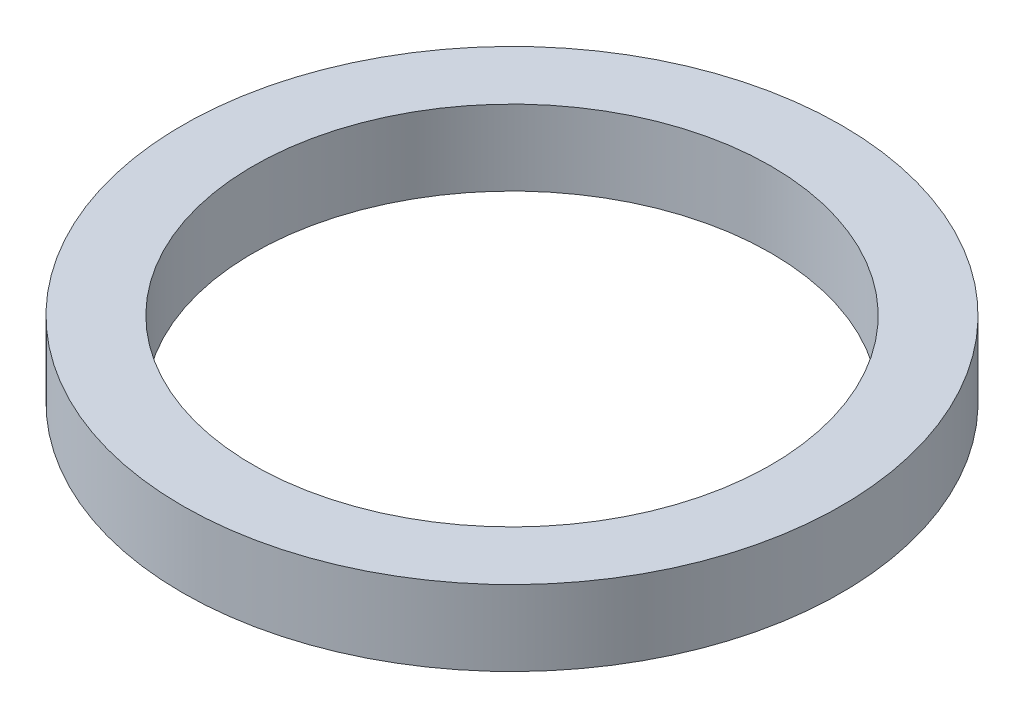
ISO-10303-21;
HEADER;
FILE_DESCRIPTION(('STEP AP214'),'2;1');
FILE_NAME('part.step','',(''),(''),'','','');
FILE_SCHEMA(('AUTOMOTIVE_DESIGN { 1 0 10303 214 1 1 1 1 }'));
ENDSEC;
DATA;
#1=APPLICATION_CONTEXT('core data for automotive mechanical design processes');
#2=APPLICATION_PROTOCOL_DEFINITION('international standard','automotive_design',2000,#1);
#3=PRODUCT_CONTEXT('',#1,'mechanical');
#4=PRODUCT('Part','Part','',(#3));
#5=PRODUCT_RELATED_PRODUCT_CATEGORY('part','',(#4));
#6=PRODUCT_DEFINITION_FORMATION('','',#4);
#7=PRODUCT_DEFINITION_CONTEXT('part definition',#1,'design');
#8=PRODUCT_DEFINITION('design','',#6,#7);
#9=PRODUCT_DEFINITION_SHAPE('','',#8);
#10=(LENGTH_UNIT() NAMED_UNIT(*) SI_UNIT(.MILLI.,.METRE.));
#11=(NAMED_UNIT(*) PLANE_ANGLE_UNIT() SI_UNIT($,.RADIAN.));
#12=(NAMED_UNIT(*) SI_UNIT($,.STERADIAN.) SOLID_ANGLE_UNIT());
#13=UNCERTAINTY_MEASURE_WITH_UNIT(LENGTH_MEASURE(1.E-05),#10,'distance_accuracy_value','');
#14=(GEOMETRIC_REPRESENTATION_CONTEXT(3) GLOBAL_UNCERTAINTY_ASSIGNED_CONTEXT((#13)) GLOBAL_UNIT_ASSIGNED_CONTEXT((#10,
#11,#12)) REPRESENTATION_CONTEXT('',''));
#15=CARTESIAN_POINT('',(0.,0.,0.));
#16=DIRECTION('',(0.,0.,1.));
#17=DIRECTION('',(1.,0.,0.));
#18=AXIS2_PLACEMENT_3D('',#15,#16,#17);
#19=CARTESIAN_POINT('',(0.,0.,0.));
#20=DIRECTION('',(0.,1.,0.));
#21=DIRECTION('',(0.,0.,1.));
#22=AXIS2_PLACEMENT_3D('',#19,#20,#21);
#23=PLANE('',#22);
#24=CARTESIAN_POINT('',(0.,0.,0.));
#25=DIRECTION('',(0.,-1.,0.));
#26=DIRECTION('',(0.,0.,-1.));
#27=AXIS2_PLACEMENT_3D('',#24,#25,#26);
#28=CIRCLE('',#27,55.);
#29=CARTESIAN_POINT('',(0.,0.,-55.));
#30=VERTEX_POINT('',#29);
#31=EDGE_CURVE('E26',#30,#30,#28,.F.);
#32=ORIENTED_EDGE('',*,*,#31,.T.);
#33=EDGE_LOOP('',(#32));
#34=FACE_BOUND('',#33,.T.);
#35=CARTESIAN_POINT('',(0.,0.,0.));
#36=DIRECTION('',(0.,-1.,0.));
#37=DIRECTION('',(0.,0.,-1.));
#38=AXIS2_PLACEMENT_3D('',#35,#36,#37);
#39=CIRCLE('',#38,70.);
#40=CARTESIAN_POINT('',(0.,0.,-70.));
#41=VERTEX_POINT('',#40);
#42=EDGE_CURVE('E17',#41,#41,#39,.F.);
#43=ORIENTED_EDGE('',*,*,#42,.F.);
#44=EDGE_LOOP('',(#43));
#45=FACE_BOUND('',#44,.T.);
#46=ADVANCED_FACE('F14',(#34,#45),#23,.F.);
#47=CARTESIAN_POINT('',(0.,16.,0.));
#48=DIRECTION('',(0.,-1.,0.));
#49=DIRECTION('',(0.,0.,-1.));
#50=AXIS2_PLACEMENT_3D('',#47,#48,#49);
#51=CYLINDRICAL_SURFACE('',#50,70.);
#52=ORIENTED_EDGE('',*,*,#42,.T.);
#53=EDGE_LOOP('',(#52));
#54=FACE_BOUND('',#53,.T.);
#55=CARTESIAN_POINT('',(0.,16.,0.));
#56=DIRECTION('',(0.,-1.,0.));
#57=DIRECTION('',(0.,0.,-1.));
#58=AXIS2_PLACEMENT_3D('',#55,#56,#57);
#59=CIRCLE('',#58,70.);
#60=CARTESIAN_POINT('',(0.,16.,-70.));
#61=VERTEX_POINT('',#60);
#62=EDGE_CURVE('E21',#61,#61,#59,.F.);
#63=ORIENTED_EDGE('',*,*,#62,.F.);
#64=EDGE_LOOP('',(#63));
#65=FACE_BOUND('',#64,.T.);
#66=ADVANCED_FACE('F34',(#54,#65),#51,.T.);
#67=CARTESIAN_POINT('',(0.,16.,0.));
#68=DIRECTION('',(0.,-1.,0.));
#69=DIRECTION('',(0.,0.,-1.));
#70=AXIS2_PLACEMENT_3D('',#67,#68,#69);
#71=CYLINDRICAL_SURFACE('',#70,55.);
#72=CARTESIAN_POINT('',(0.,16.,0.));
#73=DIRECTION('',(0.,-1.,0.));
#74=DIRECTION('',(0.,0.,-1.));
#75=AXIS2_PLACEMENT_3D('',#72,#73,#74);
#76=CIRCLE('',#75,55.);
#77=CARTESIAN_POINT('',(0.,16.,-55.));
#78=VERTEX_POINT('',#77);
#79=EDGE_CURVE('E10',#78,#78,#76,.T.);
#80=ORIENTED_EDGE('',*,*,#79,.F.);
#81=EDGE_LOOP('',(#80));
#82=FACE_BOUND('',#81,.T.);
#83=ORIENTED_EDGE('',*,*,#31,.F.);
#84=EDGE_LOOP('',(#83));
#85=FACE_BOUND('',#84,.T.);
#86=ADVANCED_FACE('F42',(#82,#85),#71,.F.);
#87=CARTESIAN_POINT('',(0.,16.,0.));
#88=DIRECTION('',(0.,1.,0.));
#89=DIRECTION('',(0.,0.,1.));
#90=AXIS2_PLACEMENT_3D('',#87,#88,#89);
#91=PLANE('',#90);
#92=ORIENTED_EDGE('',*,*,#79,.T.);
#93=EDGE_LOOP('',(#92));
#94=FACE_BOUND('',#93,.T.);
#95=ORIENTED_EDGE('',*,*,#62,.T.);
#96=EDGE_LOOP('',(#95));
#97=FACE_BOUND('',#96,.T.);
#98=ADVANCED_FACE('F43',(#94,#97),#91,.T.);
#99=CLOSED_SHELL('',(#46,#66,#86,#98));
#100=MANIFOLD_SOLID_BREP('B1',#99);
#101=ADVANCED_BREP_SHAPE_REPRESENTATION('',(#18,#100),#14);
#102=SHAPE_DEFINITION_REPRESENTATION(#9,#101);
ENDSEC;
END-ISO-10303-21;
